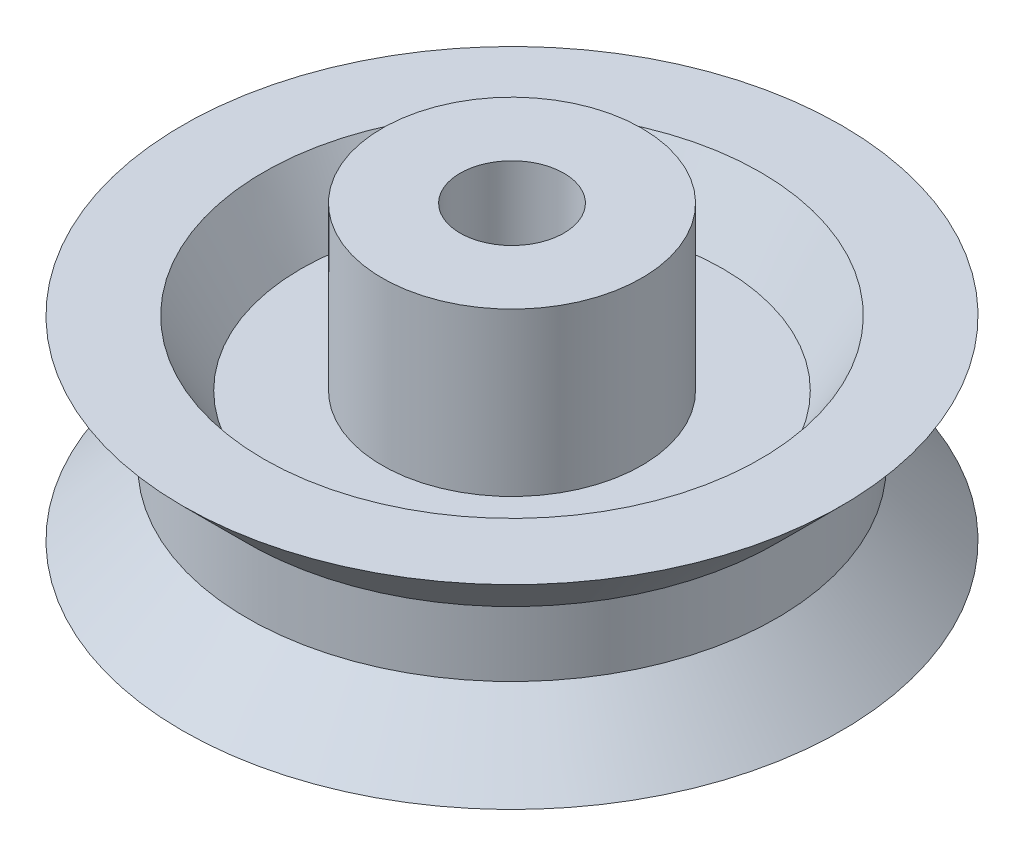
ISO-10303-21;
HEADER;
FILE_DESCRIPTION(('STEP AP214'),'2;1');
FILE_NAME('part.step','',(''),(''),'','','');
FILE_SCHEMA(('AUTOMOTIVE_DESIGN { 1 0 10303 214 1 1 1 1 }'));
ENDSEC;
DATA;
#1=APPLICATION_CONTEXT('core data for automotive mechanical design processes');
#2=APPLICATION_PROTOCOL_DEFINITION('international standard','automotive_design',2000,#1);
#3=PRODUCT_CONTEXT('',#1,'mechanical');
#4=PRODUCT('Part','Part','',(#3));
#5=PRODUCT_RELATED_PRODUCT_CATEGORY('part','',(#4));
#6=PRODUCT_DEFINITION_FORMATION('','',#4);
#7=PRODUCT_DEFINITION_CONTEXT('part definition',#1,'design');
#8=PRODUCT_DEFINITION('design','',#6,#7);
#9=PRODUCT_DEFINITION_SHAPE('','',#8);
#10=(LENGTH_UNIT() NAMED_UNIT(*) SI_UNIT(.MILLI.,.METRE.));
#11=(NAMED_UNIT(*) PLANE_ANGLE_UNIT() SI_UNIT($,.RADIAN.));
#12=(NAMED_UNIT(*) SI_UNIT($,.STERADIAN.) SOLID_ANGLE_UNIT());
#13=UNCERTAINTY_MEASURE_WITH_UNIT(LENGTH_MEASURE(1.E-05),#10,'distance_accuracy_value','');
#14=(GEOMETRIC_REPRESENTATION_CONTEXT(3) GLOBAL_UNCERTAINTY_ASSIGNED_CONTEXT((#13)) GLOBAL_UNIT_ASSIGNED_CONTEXT((#10,
#11,#12)) REPRESENTATION_CONTEXT('',''));
#15=CARTESIAN_POINT('',(0.,0.,0.));
#16=DIRECTION('',(0.,0.,1.));
#17=DIRECTION('',(1.,0.,0.));
#18=AXIS2_PLACEMENT_3D('',#15,#16,#17);
#19=CARTESIAN_POINT('',(0.,-4.99999999999997,-1.6));
#20=DIRECTION('',(0.,-1.,0.));
#21=DIRECTION('',(0.,0.,-1.));
#22=AXIS2_PLACEMENT_3D('',#19,#20,#21);
#23=PLANE('',#22);
#24=CARTESIAN_POINT('',(0.,-4.99999999999997,0.));
#25=DIRECTION('',(0.,-1.,0.));
#26=DIRECTION('',(0.,0.,-1.));
#27=AXIS2_PLACEMENT_3D('',#24,#25,#26);
#28=CIRCLE('',#27,4.);
#29=CARTESIAN_POINT('',(0.,-4.99999999999997,-4.));
#30=VERTEX_POINT('',#29);
#31=EDGE_CURVE('E77',#30,#30,#28,.T.);
#32=ORIENTED_EDGE('',*,*,#31,.T.);
#33=EDGE_LOOP('',(#32));
#34=FACE_BOUND('',#33,.T.);
#35=CARTESIAN_POINT('',(0.,-4.99999999999997,0.));
#36=DIRECTION('',(0.,-1.,0.));
#37=DIRECTION('',(0.,0.,-1.));
#38=AXIS2_PLACEMENT_3D('',#35,#36,#37);
#39=CIRCLE('',#38,1.6);
#40=CARTESIAN_POINT('',(0.,-4.99999999999997,-1.6));
#41=VERTEX_POINT('',#40);
#42=EDGE_CURVE('E10',#41,#41,#39,.T.);
#43=ORIENTED_EDGE('',*,*,#42,.F.);
#44=EDGE_LOOP('',(#43));
#45=FACE_BOUND('',#44,.T.);
#46=ADVANCED_FACE('F31',(#34,#45),#23,.T.);
#47=CARTESIAN_POINT('',(0.,0.,0.));
#48=DIRECTION('',(0.,-1.,0.));
#49=DIRECTION('',(0.,0.,-1.));
#50=AXIS2_PLACEMENT_3D('',#47,#48,#49);
#51=CYLINDRICAL_SURFACE('',#50,1.6);
#52=ORIENTED_EDGE('',*,*,#42,.T.);
#53=EDGE_LOOP('',(#52));
#54=FACE_BOUND('',#53,.T.);
#55=CARTESIAN_POINT('',(0.,7.00000000000003,0.));
#56=DIRECTION('',(0.,-1.,0.));
#57=DIRECTION('',(0.,0.,-1.));
#58=AXIS2_PLACEMENT_3D('',#55,#56,#57);
#59=CIRCLE('',#58,1.6);
#60=CARTESIAN_POINT('',(0.,7.00000000000003,-1.6));
#61=VERTEX_POINT('',#60);
#62=EDGE_CURVE('E37',#61,#61,#59,.T.);
#63=ORIENTED_EDGE('',*,*,#62,.F.);
#64=EDGE_LOOP('',(#63));
#65=FACE_BOUND('',#64,.T.);
#66=ADVANCED_FACE('F95',(#54,#65),#51,.F.);
#67=CARTESIAN_POINT('',(0.,7.00000000000003,-4.));
#68=DIRECTION('',(0.,1.,0.));
#69=DIRECTION('',(0.,0.,1.));
#70=AXIS2_PLACEMENT_3D('',#67,#68,#69);
#71=PLANE('',#70);
#72=ORIENTED_EDGE('',*,*,#62,.T.);
#73=EDGE_LOOP('',(#72));
#74=FACE_BOUND('',#73,.T.);
#75=CARTESIAN_POINT('',(0.,7.00000000000003,0.));
#76=DIRECTION('',(0.,-1.,0.));
#77=DIRECTION('',(0.,0.,-1.));
#78=AXIS2_PLACEMENT_3D('',#75,#76,#77);
#79=CIRCLE('',#78,4.);
#80=CARTESIAN_POINT('',(0.,7.00000000000003,-4.));
#81=VERTEX_POINT('',#80);
#82=EDGE_CURVE('E41',#81,#81,#79,.T.);
#83=ORIENTED_EDGE('',*,*,#82,.F.);
#84=EDGE_LOOP('',(#83));
#85=FACE_BOUND('',#84,.T.);
#86=ADVANCED_FACE('F99',(#74,#85),#71,.T.);
#87=CARTESIAN_POINT('',(0.,0.,0.));
#88=DIRECTION('',(0.,-1.,0.));
#89=DIRECTION('',(0.,0.,-1.));
#90=AXIS2_PLACEMENT_3D('',#87,#88,#89);
#91=CYLINDRICAL_SURFACE('',#90,4.);
#92=ORIENTED_EDGE('',*,*,#82,.T.);
#93=EDGE_LOOP('',(#92));
#94=FACE_BOUND('',#93,.T.);
#95=CARTESIAN_POINT('',(0.,2.00000000000003,0.));
#96=DIRECTION('',(0.,-1.,0.));
#97=DIRECTION('',(0.,0.,-1.));
#98=AXIS2_PLACEMENT_3D('',#95,#96,#97);
#99=CIRCLE('',#98,4.);
#100=CARTESIAN_POINT('',(0.,2.00000000000003,-4.));
#101=VERTEX_POINT('',#100);
#102=EDGE_CURVE('E45',#101,#101,#99,.T.);
#103=ORIENTED_EDGE('',*,*,#102,.F.);
#104=EDGE_LOOP('',(#103));
#105=FACE_BOUND('',#104,.T.);
#106=ADVANCED_FACE('F103',(#94,#105),#91,.T.);
#107=CARTESIAN_POINT('',(0.,2.00000000000003,-6.49999999999985));
#108=DIRECTION('',(0.,1.,0.));
#109=DIRECTION('',(0.,0.,1.));
#110=AXIS2_PLACEMENT_3D('',#107,#108,#109);
#111=PLANE('',#110);
#112=ORIENTED_EDGE('',*,*,#102,.T.);
#113=EDGE_LOOP('',(#112));
#114=FACE_BOUND('',#113,.T.);
#115=CARTESIAN_POINT('',(0.,2.00000000000003,0.));
#116=DIRECTION('',(0.,-1.,0.));
#117=DIRECTION('',(0.,0.,-1.));
#118=AXIS2_PLACEMENT_3D('',#115,#116,#117);
#119=CIRCLE('',#118,6.49999999999985);
#120=CARTESIAN_POINT('',(0.,2.00000000000003,-6.49999999999985));
#121=VERTEX_POINT('',#120);
#122=EDGE_CURVE('E50',#121,#121,#119,.T.);
#123=ORIENTED_EDGE('',*,*,#122,.F.);
#124=EDGE_LOOP('',(#123));
#125=FACE_BOUND('',#124,.T.);
#126=ADVANCED_FACE('F109',(#114,#125),#111,.T.);
#127=CARTESIAN_POINT('',(0.,4.00000000000003,0.));
#128=DIRECTION('',(0.,1.,0.));
#129=DIRECTION('',(0.,0.,1.));
#130=AXIS2_PLACEMENT_3D('',#127,#128,#129);
#131=CONICAL_SURFACE('',#130,7.6547005383791,0.523598775598296);
#132=ORIENTED_EDGE('',*,*,#122,.T.);
#133=EDGE_LOOP('',(#132));
#134=FACE_BOUND('',#133,.T.);
#135=CARTESIAN_POINT('',(0.,4.00000000000003,0.));
#136=DIRECTION('',(0.,-1.,0.));
#137=DIRECTION('',(0.,0.,-1.));
#138=AXIS2_PLACEMENT_3D('',#135,#136,#137);
#139=CIRCLE('',#138,7.6547005383791);
#140=CARTESIAN_POINT('',(0.,4.00000000000003,-7.6547005383791));
#141=VERTEX_POINT('',#140);
#142=EDGE_CURVE('E53',#141,#141,#139,.T.);
#143=ORIENTED_EDGE('',*,*,#142,.F.);
#144=EDGE_LOOP('',(#143));
#145=FACE_BOUND('',#144,.T.);
#146=ADVANCED_FACE('F113',(#134,#145),#131,.F.);
#147=CARTESIAN_POINT('',(0.,4.00000000000003,-10.1547005383791));
#148=DIRECTION('',(0.,1.,0.));
#149=DIRECTION('',(0.,0.,1.));
#150=AXIS2_PLACEMENT_3D('',#147,#148,#149);
#151=PLANE('',#150);
#152=ORIENTED_EDGE('',*,*,#142,.T.);
#153=EDGE_LOOP('',(#152));
#154=FACE_BOUND('',#153,.T.);
#155=CARTESIAN_POINT('',(0.,4.00000000000003,0.));
#156=DIRECTION('',(0.,-1.,0.));
#157=DIRECTION('',(0.,0.,-1.));
#158=AXIS2_PLACEMENT_3D('',#155,#156,#157);
#159=CIRCLE('',#158,10.1547005383791);
#160=CARTESIAN_POINT('',(0.,4.00000000000003,-10.1547005383791));
#161=VERTEX_POINT('',#160);
#162=EDGE_CURVE('E56',#161,#161,#159,.T.);
#163=ORIENTED_EDGE('',*,*,#162,.F.);
#164=EDGE_LOOP('',(#163));
#165=FACE_BOUND('',#164,.T.);
#166=ADVANCED_FACE('F117',(#154,#165),#151,.T.);
#167=CARTESIAN_POINT('',(0.,2.00000000000003,0.));
#168=DIRECTION('',(0.,1.,0.));
#169=DIRECTION('',(0.,0.,1.));
#170=AXIS2_PLACEMENT_3D('',#167,#168,#169);
#171=CONICAL_SURFACE('',#170,8.15470053837923,0.785398163397417);
#172=ORIENTED_EDGE('',*,*,#162,.T.);
#173=EDGE_LOOP('',(#172));
#174=FACE_BOUND('',#173,.T.);
#175=CARTESIAN_POINT('',(0.,2.00000000000003,0.));
#176=DIRECTION('',(0.,-1.,0.));
#177=DIRECTION('',(0.,0.,-1.));
#178=AXIS2_PLACEMENT_3D('',#175,#176,#177);
#179=CIRCLE('',#178,8.15470053837923);
#180=CARTESIAN_POINT('',(0.,2.00000000000003,-8.15470053837923));
#181=VERTEX_POINT('',#180);
#182=EDGE_CURVE('E59',#181,#181,#179,.T.);
#183=ORIENTED_EDGE('',*,*,#182,.F.);
#184=EDGE_LOOP('',(#183));
#185=FACE_BOUND('',#184,.T.);
#186=ADVANCED_FACE('F121',(#174,#185),#171,.T.);
#187=CARTESIAN_POINT('',(0.,0.,0.));
#188=DIRECTION('',(0.,-1.,0.));
#189=DIRECTION('',(0.,0.,-1.));
#190=AXIS2_PLACEMENT_3D('',#187,#188,#189);
#191=CYLINDRICAL_SURFACE('',#190,8.15470053837923);
#192=ORIENTED_EDGE('',*,*,#182,.T.);
#193=EDGE_LOOP('',(#192));
#194=FACE_BOUND('',#193,.T.);
#195=CARTESIAN_POINT('',(0.,0.,0.));
#196=DIRECTION('',(0.,-1.,0.));
#197=DIRECTION('',(0.,0.,-1.));
#198=AXIS2_PLACEMENT_3D('',#195,#196,#197);
#199=CIRCLE('',#198,8.15470053837923);
#200=CARTESIAN_POINT('',(0.,0.,-8.15470053837923));
#201=VERTEX_POINT('',#200);
#202=EDGE_CURVE('E62',#201,#201,#199,.T.);
#203=ORIENTED_EDGE('',*,*,#202,.F.);
#204=EDGE_LOOP('',(#203));
#205=FACE_BOUND('',#204,.T.);
#206=ADVANCED_FACE('F125',(#194,#205),#191,.T.);
#207=CARTESIAN_POINT('',(0.,-1.99999999999997,0.));
#208=DIRECTION('',(0.,-1.,0.));
#209=DIRECTION('',(0.,0.,-1.));
#210=AXIS2_PLACEMENT_3D('',#207,#208,#209);
#211=CONICAL_SURFACE('',#210,10.1547005383792,0.78539816339745);
#212=ORIENTED_EDGE('',*,*,#202,.T.);
#213=EDGE_LOOP('',(#212));
#214=FACE_BOUND('',#213,.T.);
#215=CARTESIAN_POINT('',(0.,-1.99999999999997,0.));
#216=DIRECTION('',(0.,-1.,0.));
#217=DIRECTION('',(0.,0.,-1.));
#218=AXIS2_PLACEMENT_3D('',#215,#216,#217);
#219=CIRCLE('',#218,10.1547005383792);
#220=CARTESIAN_POINT('',(0.,-1.99999999999997,-10.1547005383792));
#221=VERTEX_POINT('',#220);
#222=EDGE_CURVE('E65',#221,#221,#219,.T.);
#223=ORIENTED_EDGE('',*,*,#222,.F.);
#224=EDGE_LOOP('',(#223));
#225=FACE_BOUND('',#224,.T.);
#226=ADVANCED_FACE('F129',(#214,#225),#211,.T.);
#227=CARTESIAN_POINT('',(0.,-1.99999999999997,-7.6547005383791));
#228=DIRECTION('',(0.,-1.,0.));
#229=DIRECTION('',(0.,0.,-1.));
#230=AXIS2_PLACEMENT_3D('',#227,#228,#229);
#231=PLANE('',#230);
#232=ORIENTED_EDGE('',*,*,#222,.T.);
#233=EDGE_LOOP('',(#232));
#234=FACE_BOUND('',#233,.T.);
#235=CARTESIAN_POINT('',(0.,-1.99999999999997,0.));
#236=DIRECTION('',(0.,-1.,0.));
#237=DIRECTION('',(0.,0.,-1.));
#238=AXIS2_PLACEMENT_3D('',#235,#236,#237);
#239=CIRCLE('',#238,7.6547005383791);
#240=CARTESIAN_POINT('',(0.,-1.99999999999997,-7.6547005383791));
#241=VERTEX_POINT('',#240);
#242=EDGE_CURVE('E68',#241,#241,#239,.T.);
#243=ORIENTED_EDGE('',*,*,#242,.F.);
#244=EDGE_LOOP('',(#243));
#245=FACE_BOUND('',#244,.T.);
#246=ADVANCED_FACE('F133',(#234,#245),#231,.T.);
#247=CARTESIAN_POINT('',(0.,0.,0.));
#248=DIRECTION('',(0.,-1.,0.));
#249=DIRECTION('',(0.,0.,-1.));
#250=AXIS2_PLACEMENT_3D('',#247,#248,#249);
#251=CONICAL_SURFACE('',#250,6.5,0.523598775598241);
#252=ORIENTED_EDGE('',*,*,#242,.T.);
#253=EDGE_LOOP('',(#252));
#254=FACE_BOUND('',#253,.T.);
#255=CARTESIAN_POINT('',(0.,0.,0.));
#256=DIRECTION('',(0.,-1.,0.));
#257=DIRECTION('',(0.,0.,-1.));
#258=AXIS2_PLACEMENT_3D('',#255,#256,#257);
#259=CIRCLE('',#258,6.5);
#260=CARTESIAN_POINT('',(0.,0.,-6.5));
#261=VERTEX_POINT('',#260);
#262=EDGE_CURVE('E71',#261,#261,#259,.T.);
#263=ORIENTED_EDGE('',*,*,#262,.F.);
#264=EDGE_LOOP('',(#263));
#265=FACE_BOUND('',#264,.T.);
#266=ADVANCED_FACE('F91',(#254,#265),#251,.F.);
#267=CARTESIAN_POINT('',(0.,0.,-4.));
#268=DIRECTION('',(0.,-1.,0.));
#269=DIRECTION('',(0.,0.,-1.));
#270=AXIS2_PLACEMENT_3D('',#267,#268,#269);
#271=PLANE('',#270);
#272=ORIENTED_EDGE('',*,*,#262,.T.);
#273=EDGE_LOOP('',(#272));
#274=FACE_BOUND('',#273,.T.);
#275=CARTESIAN_POINT('',(0.,0.,0.));
#276=DIRECTION('',(0.,-1.,0.));
#277=DIRECTION('',(0.,0.,-1.));
#278=AXIS2_PLACEMENT_3D('',#275,#276,#277);
#279=CIRCLE('',#278,4.);
#280=CARTESIAN_POINT('',(0.,0.,-4.));
#281=VERTEX_POINT('',#280);
#282=EDGE_CURVE('E74',#281,#281,#279,.T.);
#283=ORIENTED_EDGE('',*,*,#282,.F.);
#284=EDGE_LOOP('',(#283));
#285=FACE_BOUND('',#284,.T.);
#286=ADVANCED_FACE('F85',(#274,#285),#271,.T.);
#287=CARTESIAN_POINT('',(0.,0.,0.));
#288=DIRECTION('',(0.,-1.,0.));
#289=DIRECTION('',(0.,0.,-1.));
#290=AXIS2_PLACEMENT_3D('',#287,#288,#289);
#291=CYLINDRICAL_SURFACE('',#290,4.);
#292=ORIENTED_EDGE('',*,*,#282,.T.);
#293=EDGE_LOOP('',(#292));
#294=FACE_BOUND('',#293,.T.);
#295=ORIENTED_EDGE('',*,*,#31,.F.);
#296=EDGE_LOOP('',(#295));
#297=FACE_BOUND('',#296,.T.);
#298=ADVANCED_FACE('F83',(#294,#297),#291,.T.);
#299=CLOSED_SHELL('',(#46,#66,#86,#106,#126,#146,#166,#186,#206,#226,#246,#266,#286,#298));
#300=MANIFOLD_SOLID_BREP('B2',#299);
#301=ADVANCED_BREP_SHAPE_REPRESENTATION('',(#18,#300),#14);
#302=SHAPE_DEFINITION_REPRESENTATION(#9,#301);
ENDSEC;
END-ISO-10303-21;
